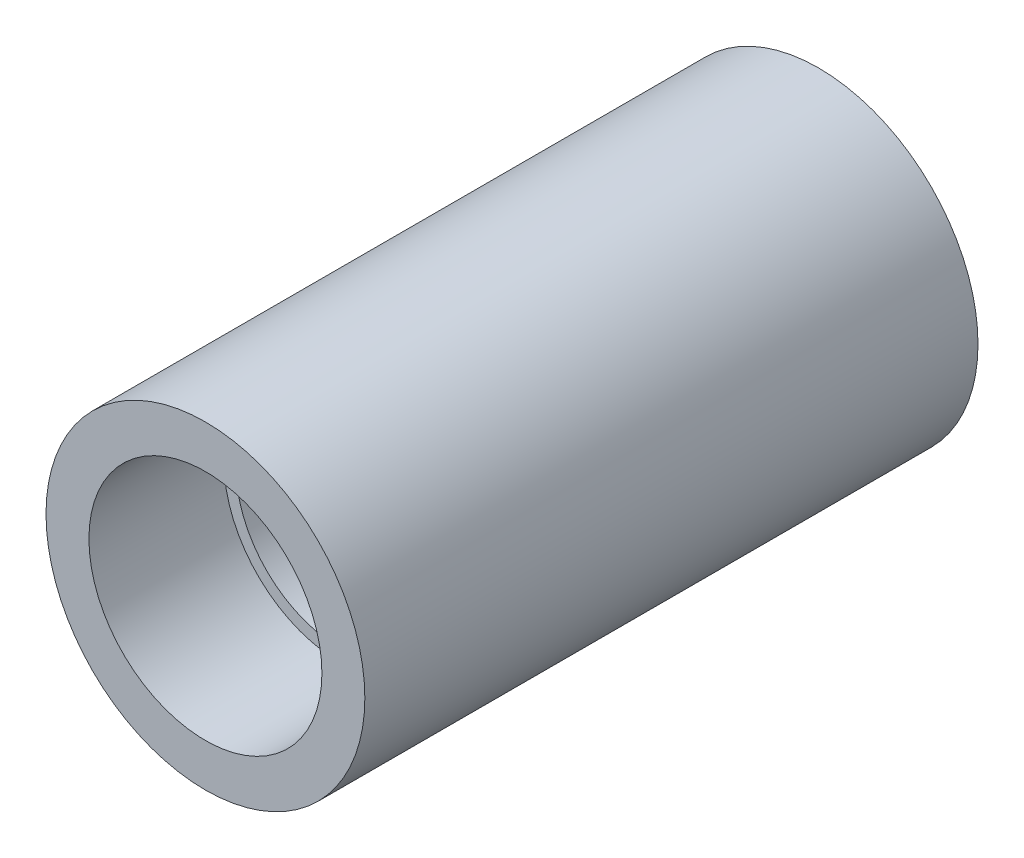
ISO-10303-21;
HEADER;
FILE_DESCRIPTION(('STEP AP214'),'2;1');
FILE_NAME('part.step','',(''),(''),'','','');
FILE_SCHEMA(('AUTOMOTIVE_DESIGN { 1 0 10303 214 1 1 1 1 }'));
ENDSEC;
DATA;
#1=APPLICATION_CONTEXT('core data for automotive mechanical design processes');
#2=APPLICATION_PROTOCOL_DEFINITION('international standard','automotive_design',2000,#1);
#3=PRODUCT_CONTEXT('',#1,'mechanical');
#4=PRODUCT('Part','Part','',(#3));
#5=PRODUCT_RELATED_PRODUCT_CATEGORY('part','',(#4));
#6=PRODUCT_DEFINITION_FORMATION('','',#4);
#7=PRODUCT_DEFINITION_CONTEXT('part definition',#1,'design');
#8=PRODUCT_DEFINITION('design','',#6,#7);
#9=PRODUCT_DEFINITION_SHAPE('','',#8);
#10=(LENGTH_UNIT() NAMED_UNIT(*) SI_UNIT(.MILLI.,.METRE.));
#11=(NAMED_UNIT(*) PLANE_ANGLE_UNIT() SI_UNIT($,.RADIAN.));
#12=(NAMED_UNIT(*) SI_UNIT($,.STERADIAN.) SOLID_ANGLE_UNIT());
#13=UNCERTAINTY_MEASURE_WITH_UNIT(LENGTH_MEASURE(1.E-05),#10,'distance_accuracy_value','');
#14=(GEOMETRIC_REPRESENTATION_CONTEXT(3) GLOBAL_UNCERTAINTY_ASSIGNED_CONTEXT((#13)) GLOBAL_UNIT_ASSIGNED_CONTEXT((#10,
#11,#12)) REPRESENTATION_CONTEXT('',''));
#15=CARTESIAN_POINT('',(0.,0.,0.));
#16=DIRECTION('',(0.,0.,1.));
#17=DIRECTION('',(1.,0.,0.));
#18=AXIS2_PLACEMENT_3D('',#15,#16,#17);
#19=CARTESIAN_POINT('',(5.65484353757029,0.,25.));
#20=DIRECTION('',(0.,0.,-1.));
#21=DIRECTION('',(-1.,0.,0.));
#22=AXIS2_PLACEMENT_3D('',#19,#20,#21);
#23=CYLINDRICAL_SURFACE('',#22,6.5);
#24=CARTESIAN_POINT('',(5.65484353757029,0.,25.));
#25=DIRECTION('',(0.,0.,1.));
#26=DIRECTION('',(1.,0.,0.));
#27=AXIS2_PLACEMENT_3D('',#24,#25,#26);
#28=CIRCLE('',#27,6.5);
#29=CARTESIAN_POINT('',(12.1548435375703,0.,25.));
#30=VERTEX_POINT('',#29);
#31=EDGE_CURVE('E12',#30,#30,#28,.T.);
#32=ORIENTED_EDGE('',*,*,#31,.F.);
#33=EDGE_LOOP('',(#32));
#34=FACE_BOUND('',#33,.T.);
#35=CARTESIAN_POINT('',(5.65484353757029,0.,0.));
#36=DIRECTION('',(0.,0.,1.));
#37=DIRECTION('',(1.,0.,0.));
#38=AXIS2_PLACEMENT_3D('',#35,#36,#37);
#39=CIRCLE('',#38,6.5);
#40=CARTESIAN_POINT('',(12.1548435375703,0.,0.));
#41=VERTEX_POINT('',#40);
#42=EDGE_CURVE('E48',#41,#41,#39,.T.);
#43=ORIENTED_EDGE('',*,*,#42,.T.);
#44=EDGE_LOOP('',(#43));
#45=FACE_BOUND('',#44,.T.);
#46=ADVANCED_FACE('F45',(#34,#45),#23,.T.);
#47=CARTESIAN_POINT('',(5.65484353757029,0.,25.));
#48=DIRECTION('',(0.,0.,1.));
#49=DIRECTION('',(1.,0.,0.));
#50=AXIS2_PLACEMENT_3D('',#47,#48,#49);
#51=PLANE('',#50);
#52=CARTESIAN_POINT('',(5.65484353757029,0.,25.));
#53=DIRECTION('',(0.,0.,1.));
#54=DIRECTION('',(1.,0.,0.));
#55=AXIS2_PLACEMENT_3D('',#52,#53,#54);
#56=CIRCLE('',#55,4.75);
#57=CARTESIAN_POINT('',(10.4048435375703,0.,25.));
#58=VERTEX_POINT('',#57);
#59=EDGE_CURVE('E57',#58,#58,#56,.T.);
#60=ORIENTED_EDGE('',*,*,#59,.F.);
#61=EDGE_LOOP('',(#60));
#62=FACE_BOUND('',#61,.T.);
#63=ORIENTED_EDGE('',*,*,#31,.T.);
#64=EDGE_LOOP('',(#63));
#65=FACE_BOUND('',#64,.T.);
#66=ADVANCED_FACE('F109',(#62,#65),#51,.T.);
#67=CARTESIAN_POINT('',(5.65484353757029,0.,0.));
#68=DIRECTION('',(0.,0.,1.));
#69=DIRECTION('',(1.,0.,0.));
#70=AXIS2_PLACEMENT_3D('',#67,#68,#69);
#71=PLANE('',#70);
#72=CARTESIAN_POINT('',(5.65484353757029,0.,0.));
#73=DIRECTION('',(0.,0.,-1.));
#74=DIRECTION('',(-1.,0.,0.));
#75=AXIS2_PLACEMENT_3D('',#72,#73,#74);
#76=CIRCLE('',#75,4.75);
#77=CARTESIAN_POINT('',(0.904843537570287,0.,0.));
#78=VERTEX_POINT('',#77);
#79=EDGE_CURVE('E69',#78,#78,#76,.T.);
#80=ORIENTED_EDGE('',*,*,#79,.F.);
#81=EDGE_LOOP('',(#80));
#82=FACE_BOUND('',#81,.T.);
#83=ORIENTED_EDGE('',*,*,#42,.F.);
#84=EDGE_LOOP('',(#83));
#85=FACE_BOUND('',#84,.T.);
#86=ADVANCED_FACE('F105',(#82,#85),#71,.F.);
#87=CARTESIAN_POINT('',(5.65484353757029,0.,19.5));
#88=DIRECTION('',(0.,0.,1.));
#89=DIRECTION('',(1.,0.,0.));
#90=AXIS2_PLACEMENT_3D('',#87,#88,#89);
#91=CYLINDRICAL_SURFACE('',#90,4.75);
#92=CARTESIAN_POINT('',(5.65484353757029,0.,19.5));
#93=DIRECTION('',(0.,0.,1.));
#94=DIRECTION('',(1.,0.,0.));
#95=AXIS2_PLACEMENT_3D('',#92,#93,#94);
#96=CIRCLE('',#95,4.75);
#97=CARTESIAN_POINT('',(10.4048435375703,0.,19.5));
#98=VERTEX_POINT('',#97);
#99=EDGE_CURVE('E55',#98,#98,#96,.T.);
#100=ORIENTED_EDGE('',*,*,#99,.F.);
#101=EDGE_LOOP('',(#100));
#102=FACE_BOUND('',#101,.T.);
#103=ORIENTED_EDGE('',*,*,#59,.T.);
#104=EDGE_LOOP('',(#103));
#105=FACE_BOUND('',#104,.T.);
#106=ADVANCED_FACE('F99',(#102,#105),#91,.F.);
#107=CARTESIAN_POINT('',(5.65484353757029,0.,19.5));
#108=DIRECTION('',(0.,0.,1.));
#109=DIRECTION('',(1.,0.,0.));
#110=AXIS2_PLACEMENT_3D('',#107,#108,#109);
#111=PLANE('',#110);
#112=CARTESIAN_POINT('',(5.65484353757029,0.,19.5));
#113=DIRECTION('',(0.,0.,1.));
#114=DIRECTION('',(1.,0.,0.));
#115=AXIS2_PLACEMENT_3D('',#112,#113,#114);
#116=CIRCLE('',#115,4.25);
#117=CARTESIAN_POINT('',(9.90484353757029,0.,19.5));
#118=VERTEX_POINT('',#117);
#119=EDGE_CURVE('E63',#118,#118,#116,.T.);
#120=ORIENTED_EDGE('',*,*,#119,.F.);
#121=EDGE_LOOP('',(#120));
#122=FACE_BOUND('',#121,.T.);
#123=ORIENTED_EDGE('',*,*,#99,.T.);
#124=EDGE_LOOP('',(#123));
#125=FACE_BOUND('',#124,.T.);
#126=ADVANCED_FACE('F93',(#122,#125),#111,.T.);
#127=CARTESIAN_POINT('',(5.65484353757029,0.,14.5));
#128=DIRECTION('',(0.,0.,1.));
#129=DIRECTION('',(1.,0.,0.));
#130=AXIS2_PLACEMENT_3D('',#127,#128,#129);
#131=CYLINDRICAL_SURFACE('',#130,4.25);
#132=CARTESIAN_POINT('',(5.65484353757029,0.,14.5));
#133=DIRECTION('',(0.,0.,1.));
#134=DIRECTION('',(1.,0.,0.));
#135=AXIS2_PLACEMENT_3D('',#132,#133,#134);
#136=CIRCLE('',#135,4.25);
#137=CARTESIAN_POINT('',(9.90484353757029,0.,14.5));
#138=VERTEX_POINT('',#137);
#139=EDGE_CURVE('E60',#138,#138,#136,.T.);
#140=ORIENTED_EDGE('',*,*,#139,.F.);
#141=EDGE_LOOP('',(#140));
#142=FACE_BOUND('',#141,.T.);
#143=ORIENTED_EDGE('',*,*,#119,.T.);
#144=EDGE_LOOP('',(#143));
#145=FACE_BOUND('',#144,.T.);
#146=ADVANCED_FACE('F87',(#142,#145),#131,.F.);
#147=CARTESIAN_POINT('',(5.65484353757029,0.,14.5));
#148=DIRECTION('',(0.,0.,1.));
#149=DIRECTION('',(1.,0.,0.));
#150=AXIS2_PLACEMENT_3D('',#147,#148,#149);
#151=PLANE('',#150);
#152=CARTESIAN_POINT('',(5.65484353757029,0.,14.5));
#153=DIRECTION('',(0.,0.,1.));
#154=DIRECTION('',(1.,0.,0.));
#155=AXIS2_PLACEMENT_3D('',#152,#153,#154);
#156=CIRCLE('',#155,2.75);
#157=CARTESIAN_POINT('',(8.40484353757028,0.,14.5));
#158=VERTEX_POINT('',#157);
#159=EDGE_CURVE('E72',#158,#158,#156,.T.);
#160=ORIENTED_EDGE('',*,*,#159,.F.);
#161=EDGE_LOOP('',(#160));
#162=FACE_BOUND('',#161,.T.);
#163=ORIENTED_EDGE('',*,*,#139,.T.);
#164=EDGE_LOOP('',(#163));
#165=FACE_BOUND('',#164,.T.);
#166=ADVANCED_FACE('F83',(#162,#165),#151,.T.);
#167=CARTESIAN_POINT('',(5.65484353757029,0.,7.5));
#168=DIRECTION('',(0.,0.,-1.));
#169=DIRECTION('',(-1.,0.,0.));
#170=AXIS2_PLACEMENT_3D('',#167,#168,#169);
#171=CYLINDRICAL_SURFACE('',#170,4.75);
#172=CARTESIAN_POINT('',(5.65484353757029,0.,7.5));
#173=DIRECTION('',(0.,0.,-1.));
#174=DIRECTION('',(-1.,0.,0.));
#175=AXIS2_PLACEMENT_3D('',#172,#173,#174);
#176=CIRCLE('',#175,4.75);
#177=CARTESIAN_POINT('',(0.904843537570287,0.,7.5));
#178=VERTEX_POINT('',#177);
#179=EDGE_CURVE('E66',#178,#178,#176,.T.);
#180=ORIENTED_EDGE('',*,*,#179,.F.);
#181=EDGE_LOOP('',(#180));
#182=FACE_BOUND('',#181,.T.);
#183=ORIENTED_EDGE('',*,*,#79,.T.);
#184=EDGE_LOOP('',(#183));
#185=FACE_BOUND('',#184,.T.);
#186=ADVANCED_FACE('F86',(#182,#185),#171,.F.);
#187=CARTESIAN_POINT('',(5.65484353757029,0.,7.5));
#188=DIRECTION('',(0.,0.,-1.));
#189=DIRECTION('',(-1.,0.,0.));
#190=AXIS2_PLACEMENT_3D('',#187,#188,#189);
#191=PLANE('',#190);
#192=CARTESIAN_POINT('',(5.65484353757029,0.,7.5));
#193=DIRECTION('',(0.,0.,-1.));
#194=DIRECTION('',(-1.,0.,0.));
#195=AXIS2_PLACEMENT_3D('',#192,#193,#194);
#196=CIRCLE('',#195,2.75);
#197=CARTESIAN_POINT('',(2.90484353757029,0.,7.5));
#198=VERTEX_POINT('',#197);
#199=EDGE_CURVE('E75',#198,#198,#196,.F.);
#200=ORIENTED_EDGE('',*,*,#199,.T.);
#201=EDGE_LOOP('',(#200));
#202=FACE_BOUND('',#201,.T.);
#203=ORIENTED_EDGE('',*,*,#179,.T.);
#204=EDGE_LOOP('',(#203));
#205=FACE_BOUND('',#204,.T.);
#206=ADVANCED_FACE('F121',(#202,#205),#191,.T.);
#207=CARTESIAN_POINT('',(5.65484353757029,0.,-0.000999999999999265));
#208=DIRECTION('',(0.,0.,1.));
#209=DIRECTION('',(1.,0.,0.));
#210=AXIS2_PLACEMENT_3D('',#207,#208,#209);
#211=CYLINDRICAL_SURFACE('',#210,2.75);
#212=ORIENTED_EDGE('',*,*,#199,.F.);
#213=EDGE_LOOP('',(#212));
#214=FACE_BOUND('',#213,.T.);
#215=ORIENTED_EDGE('',*,*,#159,.T.);
#216=EDGE_LOOP('',(#215));
#217=FACE_BOUND('',#216,.T.);
#218=ADVANCED_FACE('F81',(#214,#217),#211,.F.);
#219=CLOSED_SHELL('',(#46,#66,#86,#106,#126,#146,#166,#186,#206,#218));
#220=MANIFOLD_SOLID_BREP('B2',#219);
#221=ADVANCED_BREP_SHAPE_REPRESENTATION('',(#18,#220),#14);
#222=SHAPE_DEFINITION_REPRESENTATION(#9,#221);
ENDSEC;
END-ISO-10303-21;
